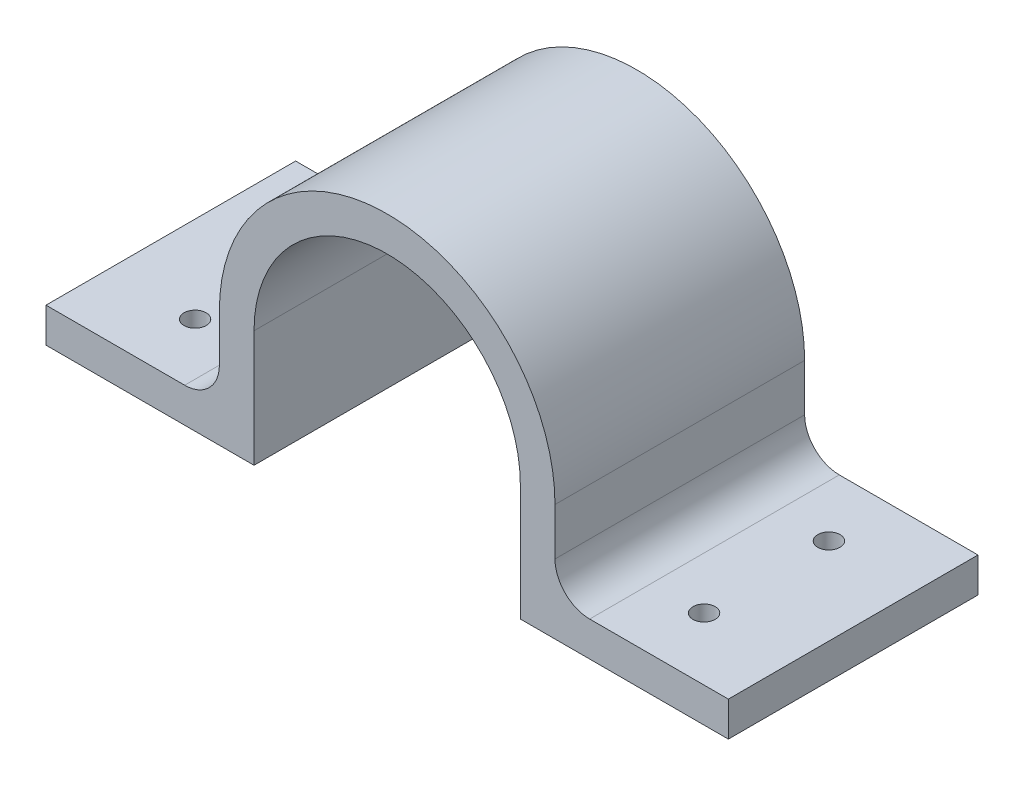
ISO-10303-21;
HEADER;
FILE_DESCRIPTION(('STEP AP214'),'2;1');
FILE_NAME('part.step','',(''),(''),'','','');
FILE_SCHEMA(('AUTOMOTIVE_DESIGN { 1 0 10303 214 1 1 1 1 }'));
ENDSEC;
DATA;
#1=APPLICATION_CONTEXT('core data for automotive mechanical design processes');
#2=APPLICATION_PROTOCOL_DEFINITION('international standard','automotive_design',2000,#1);
#3=PRODUCT_CONTEXT('',#1,'mechanical');
#4=PRODUCT('Part','Part','',(#3));
#5=PRODUCT_RELATED_PRODUCT_CATEGORY('part','',(#4));
#6=PRODUCT_DEFINITION_FORMATION('','',#4);
#7=PRODUCT_DEFINITION_CONTEXT('part definition',#1,'design');
#8=PRODUCT_DEFINITION('design','',#6,#7);
#9=PRODUCT_DEFINITION_SHAPE('','',#8);
#10=(LENGTH_UNIT() NAMED_UNIT(*) SI_UNIT(.MILLI.,.METRE.));
#11=(NAMED_UNIT(*) PLANE_ANGLE_UNIT() SI_UNIT($,.RADIAN.));
#12=(NAMED_UNIT(*) SI_UNIT($,.STERADIAN.) SOLID_ANGLE_UNIT());
#13=UNCERTAINTY_MEASURE_WITH_UNIT(LENGTH_MEASURE(1.E-05),#10,'distance_accuracy_value','');
#14=(GEOMETRIC_REPRESENTATION_CONTEXT(3) GLOBAL_UNCERTAINTY_ASSIGNED_CONTEXT((#13)) GLOBAL_UNIT_ASSIGNED_CONTEXT((#10,
#11,#12)) REPRESENTATION_CONTEXT('',''));
#15=CARTESIAN_POINT('',(0.,0.,0.));
#16=DIRECTION('',(0.,0.,1.));
#17=DIRECTION('',(1.,0.,0.));
#18=AXIS2_PLACEMENT_3D('',#15,#16,#17);
#19=CARTESIAN_POINT('',(24.2,0.,-36.));
#20=DIRECTION('',(1.,0.,0.));
#21=DIRECTION('',(0.,0.,-1.));
#22=AXIS2_PLACEMENT_3D('',#19,#20,#21);
#23=PLANE('',#22);
#24=DIRECTION('',(0.,1.,0.));
#25=VECTOR('',#24,1.);
#26=CARTESIAN_POINT('',(24.2,0.,0.));
#27=LINE('',#26,#25);
#28=CARTESIAN_POINT('',(24.2,-6.79999999999998,0.));
#29=VERTEX_POINT('',#28);
#30=CARTESIAN_POINT('',(24.2,0.,0.));
#31=VERTEX_POINT('',#30);
#32=EDGE_CURVE('E186',#29,#31,#27,.T.);
#33=ORIENTED_EDGE('',*,*,#32,.F.);
#34=DIRECTION('',(0.,0.,1.));
#35=VECTOR('',#34,1.);
#36=CARTESIAN_POINT('',(24.2,-6.79999999999998,-36.));
#37=LINE('',#36,#35);
#38=CARTESIAN_POINT('',(24.2,-6.79999999999998,-36.));
#39=VERTEX_POINT('',#38);
#40=EDGE_CURVE('E138',#29,#39,#37,.F.);
#41=ORIENTED_EDGE('',*,*,#40,.T.);
#42=DIRECTION('',(0.,1.,0.));
#43=VECTOR('',#42,1.);
#44=CARTESIAN_POINT('',(24.2,0.,-36.));
#45=LINE('',#44,#43);
#46=CARTESIAN_POINT('',(24.2,0.,-36.));
#47=VERTEX_POINT('',#46);
#48=EDGE_CURVE('E132',#39,#47,#45,.T.);
#49=ORIENTED_EDGE('',*,*,#48,.T.);
#50=DIRECTION('',(0.,0.,1.));
#51=VECTOR('',#50,1.);
#52=CARTESIAN_POINT('',(24.2,0.,-36.));
#53=LINE('',#52,#51);
#54=EDGE_CURVE('E135',#47,#31,#53,.T.);
#55=ORIENTED_EDGE('',*,*,#54,.T.);
#56=EDGE_LOOP('',(#33,#41,#49,#55));
#57=FACE_BOUND('',#56,.T.);
#58=ADVANCED_FACE('F33',(#57),#23,.T.);
#59=CARTESIAN_POINT('',(24.2,-11.8,-36.));
#60=DIRECTION('',(0.,1.,0.));
#61=DIRECTION('',(-1.,0.,0.));
#62=AXIS2_PLACEMENT_3D('',#59,#60,#61);
#63=PLANE('',#62);
#64=CARTESIAN_POINT('',(36.7,-11.8,-9.00000000000001));
#65=DIRECTION('',(0.,1.,0.));
#66=DIRECTION('',(-1.,0.,0.));
#67=AXIS2_PLACEMENT_3D('',#64,#65,#66);
#68=CIRCLE('',#67,1.59999999999999);
#69=CARTESIAN_POINT('',(35.1,-11.8,-9.00000000000001));
#70=VERTEX_POINT('',#69);
#71=EDGE_CURVE('E483',#70,#70,#68,.T.);
#72=ORIENTED_EDGE('',*,*,#71,.F.);
#73=EDGE_LOOP('',(#72));
#74=FACE_BOUND('',#73,.T.);
#75=CARTESIAN_POINT('',(36.7,-11.8,-27.));
#76=DIRECTION('',(0.,1.,0.));
#77=DIRECTION('',(1.,0.,0.));
#78=AXIS2_PLACEMENT_3D('',#75,#76,#77);
#79=CIRCLE('',#78,1.6);
#80=CARTESIAN_POINT('',(38.3,-11.8,-27.));
#81=VERTEX_POINT('',#80);
#82=EDGE_CURVE('E477',#81,#81,#79,.T.);
#83=ORIENTED_EDGE('',*,*,#82,.F.);
#84=EDGE_LOOP('',(#83));
#85=FACE_BOUND('',#84,.T.);
#86=DIRECTION('',(-1.,0.,0.));
#87=VECTOR('',#86,1.);
#88=CARTESIAN_POINT('',(24.2,-11.8,-36.));
#89=LINE('',#88,#87);
#90=CARTESIAN_POINT('',(49.2,-11.8,-36.));
#91=VERTEX_POINT('',#90);
#92=CARTESIAN_POINT('',(29.2,-11.8,-36.));
#93=VERTEX_POINT('',#92);
#94=EDGE_CURVE('E151',#91,#93,#89,.T.);
#95=ORIENTED_EDGE('',*,*,#94,.T.);
#96=DIRECTION('',(0.,0.,1.));
#97=VECTOR('',#96,1.);
#98=CARTESIAN_POINT('',(29.2,-11.8,0.));
#99=LINE('',#98,#97);
#100=CARTESIAN_POINT('',(29.2,-11.8,0.));
#101=VERTEX_POINT('',#100);
#102=EDGE_CURVE('E219',#93,#101,#99,.T.);
#103=ORIENTED_EDGE('',*,*,#102,.T.);
#104=DIRECTION('',(-1.,0.,0.));
#105=VECTOR('',#104,1.);
#106=CARTESIAN_POINT('',(24.2,-11.8,0.));
#107=LINE('',#106,#105);
#108=CARTESIAN_POINT('',(49.2,-11.8,0.));
#109=VERTEX_POINT('',#108);
#110=EDGE_CURVE('E143',#109,#101,#107,.T.);
#111=ORIENTED_EDGE('',*,*,#110,.F.);
#112=DIRECTION('',(0.,0.,1.));
#113=VECTOR('',#112,1.);
#114=CARTESIAN_POINT('',(49.2,-11.8,-36.));
#115=LINE('',#114,#113);
#116=EDGE_CURVE('E217',#91,#109,#115,.T.);
#117=ORIENTED_EDGE('',*,*,#116,.F.);
#118=EDGE_LOOP('',(#95,#103,#111,#117));
#119=FACE_BOUND('',#118,.T.);
#120=ADVANCED_FACE('F251',(#74,#85,#119),#63,.T.);
#121=CARTESIAN_POINT('',(49.2,-11.8,-36.));
#122=DIRECTION('',(1.,0.,0.));
#123=DIRECTION('',(0.,0.,-1.));
#124=AXIS2_PLACEMENT_3D('',#121,#122,#123);
#125=PLANE('',#124);
#126=DIRECTION('',(0.,1.,0.));
#127=VECTOR('',#126,1.);
#128=CARTESIAN_POINT('',(49.2,-11.8,0.));
#129=LINE('',#128,#127);
#130=CARTESIAN_POINT('',(49.2,-16.8,0.));
#131=VERTEX_POINT('',#130);
#132=EDGE_CURVE('E212',#131,#109,#129,.T.);
#133=ORIENTED_EDGE('',*,*,#132,.F.);
#134=DIRECTION('',(0.,0.,1.));
#135=VECTOR('',#134,1.);
#136=CARTESIAN_POINT('',(49.2,-16.8,-36.));
#137=LINE('',#136,#135);
#138=CARTESIAN_POINT('',(49.2,-16.8,-36.));
#139=VERTEX_POINT('',#138);
#140=EDGE_CURVE('E220',#139,#131,#137,.T.);
#141=ORIENTED_EDGE('',*,*,#140,.F.);
#142=DIRECTION('',(0.,1.,0.));
#143=VECTOR('',#142,1.);
#144=CARTESIAN_POINT('',(49.2,-11.8,-36.));
#145=LINE('',#144,#143);
#146=EDGE_CURVE('E181',#139,#91,#145,.T.);
#147=ORIENTED_EDGE('',*,*,#146,.T.);
#148=ORIENTED_EDGE('',*,*,#116,.T.);
#149=EDGE_LOOP('',(#133,#141,#147,#148));
#150=FACE_BOUND('',#149,.T.);
#151=ADVANCED_FACE('F258',(#150),#125,.T.);
#152=CARTESIAN_POINT('',(19.2,-16.8,-36.));
#153=DIRECTION('',(0.,-1.,0.));
#154=DIRECTION('',(1.,0.,0.));
#155=AXIS2_PLACEMENT_3D('',#152,#153,#154);
#156=PLANE('',#155);
#157=CARTESIAN_POINT('',(36.7,-16.8,-9.00000000000001));
#158=DIRECTION('',(0.,1.,0.));
#159=DIRECTION('',(-1.,0.,0.));
#160=AXIS2_PLACEMENT_3D('',#157,#158,#159);
#161=CIRCLE('',#160,1.59999999999999);
#162=CARTESIAN_POINT('',(35.1,-16.8,-9.00000000000001));
#163=VERTEX_POINT('',#162);
#164=EDGE_CURVE('E480',#163,#163,#161,.T.);
#165=ORIENTED_EDGE('',*,*,#164,.T.);
#166=EDGE_LOOP('',(#165));
#167=FACE_BOUND('',#166,.T.);
#168=CARTESIAN_POINT('',(36.7,-16.8,-27.));
#169=DIRECTION('',(0.,1.,0.));
#170=DIRECTION('',(1.,0.,0.));
#171=AXIS2_PLACEMENT_3D('',#168,#169,#170);
#172=CIRCLE('',#171,1.6);
#173=CARTESIAN_POINT('',(38.3,-16.8,-27.));
#174=VERTEX_POINT('',#173);
#175=EDGE_CURVE('E475',#174,#174,#172,.T.);
#176=ORIENTED_EDGE('',*,*,#175,.T.);
#177=EDGE_LOOP('',(#176));
#178=FACE_BOUND('',#177,.T.);
#179=DIRECTION('',(1.,0.,0.));
#180=VECTOR('',#179,1.);
#181=CARTESIAN_POINT('',(19.2,-16.8,0.));
#182=LINE('',#181,#180);
#183=CARTESIAN_POINT('',(19.2,-16.8,0.));
#184=VERTEX_POINT('',#183);
#185=EDGE_CURVE('E209',#184,#131,#182,.T.);
#186=ORIENTED_EDGE('',*,*,#185,.F.);
#187=DIRECTION('',(0.,0.,1.));
#188=VECTOR('',#187,1.);
#189=CARTESIAN_POINT('',(19.2,-16.8,-36.));
#190=LINE('',#189,#188);
#191=CARTESIAN_POINT('',(19.2,-16.8,-36.));
#192=VERTEX_POINT('',#191);
#193=EDGE_CURVE('E222',#192,#184,#190,.T.);
#194=ORIENTED_EDGE('',*,*,#193,.F.);
#195=DIRECTION('',(1.,0.,0.));
#196=VECTOR('',#195,1.);
#197=CARTESIAN_POINT('',(19.2,-16.8,-36.));
#198=LINE('',#197,#196);
#199=EDGE_CURVE('E178',#192,#139,#198,.T.);
#200=ORIENTED_EDGE('',*,*,#199,.T.);
#201=ORIENTED_EDGE('',*,*,#140,.T.);
#202=EDGE_LOOP('',(#186,#194,#200,#201));
#203=FACE_BOUND('',#202,.T.);
#204=ADVANCED_FACE('F262',(#167,#178,#203),#156,.T.);
#205=CARTESIAN_POINT('',(19.2,0.,-36.));
#206=DIRECTION('',(-1.,0.,0.));
#207=DIRECTION('',(0.,-1.,0.));
#208=AXIS2_PLACEMENT_3D('',#205,#206,#207);
#209=PLANE('',#208);
#210=DIRECTION('',(0.,-1.,0.));
#211=VECTOR('',#210,1.);
#212=CARTESIAN_POINT('',(19.2,0.,0.));
#213=LINE('',#212,#211);
#214=CARTESIAN_POINT('',(19.2,0.,0.));
#215=VERTEX_POINT('',#214);
#216=EDGE_CURVE('E206',#215,#184,#213,.T.);
#217=ORIENTED_EDGE('',*,*,#216,.F.);
#218=DIRECTION('',(0.,0.,1.));
#219=VECTOR('',#218,1.);
#220=CARTESIAN_POINT('',(19.2,0.,-36.));
#221=LINE('',#220,#219);
#222=CARTESIAN_POINT('',(19.2,0.,-36.));
#223=VERTEX_POINT('',#222);
#224=EDGE_CURVE('E224',#223,#215,#221,.T.);
#225=ORIENTED_EDGE('',*,*,#224,.F.);
#226=DIRECTION('',(0.,-1.,0.));
#227=VECTOR('',#226,1.);
#228=CARTESIAN_POINT('',(19.2,0.,-36.));
#229=LINE('',#228,#227);
#230=EDGE_CURVE('E175',#223,#192,#229,.T.);
#231=ORIENTED_EDGE('',*,*,#230,.T.);
#232=ORIENTED_EDGE('',*,*,#193,.T.);
#233=EDGE_LOOP('',(#217,#225,#231,#232));
#234=FACE_BOUND('',#233,.T.);
#235=ADVANCED_FACE('F265',(#234),#209,.T.);
#236=CARTESIAN_POINT('',(0.,0.,-36.));
#237=DIRECTION('',(0.,0.,1.));
#238=DIRECTION('',(1.,0.,0.));
#239=AXIS2_PLACEMENT_3D('',#236,#237,#238);
#240=CYLINDRICAL_SURFACE('',#239,19.2);
#241=CARTESIAN_POINT('',(0.,0.,0.));
#242=DIRECTION('',(0.,0.,-1.));
#243=DIRECTION('',(1.,0.,0.));
#244=AXIS2_PLACEMENT_3D('',#241,#242,#243);
#245=CIRCLE('',#244,19.2);
#246=CARTESIAN_POINT('',(-19.2,0.,0.));
#247=VERTEX_POINT('',#246);
#248=EDGE_CURVE('E203',#247,#215,#245,.T.);
#249=ORIENTED_EDGE('',*,*,#248,.F.);
#250=DIRECTION('',(0.,0.,1.));
#251=VECTOR('',#250,1.);
#252=CARTESIAN_POINT('',(-19.2,0.,-36.));
#253=LINE('',#252,#251);
#254=CARTESIAN_POINT('',(-19.2,0.,-36.));
#255=VERTEX_POINT('',#254);
#256=EDGE_CURVE('E226',#255,#247,#253,.T.);
#257=ORIENTED_EDGE('',*,*,#256,.F.);
#258=CARTESIAN_POINT('',(0.,0.,-36.));
#259=DIRECTION('',(0.,0.,-1.));
#260=DIRECTION('',(1.,0.,0.));
#261=AXIS2_PLACEMENT_3D('',#258,#259,#260);
#262=CIRCLE('',#261,19.2);
#263=EDGE_CURVE('E172',#255,#223,#262,.T.);
#264=ORIENTED_EDGE('',*,*,#263,.T.);
#265=ORIENTED_EDGE('',*,*,#224,.T.);
#266=EDGE_LOOP('',(#249,#257,#264,#265));
#267=FACE_BOUND('',#266,.T.);
#268=ADVANCED_FACE('F270',(#267),#240,.F.);
#269=CARTESIAN_POINT('',(-19.2,0.,-36.));
#270=DIRECTION('',(1.,0.,0.));
#271=DIRECTION('',(0.,0.,-1.));
#272=AXIS2_PLACEMENT_3D('',#269,#270,#271);
#273=PLANE('',#272);
#274=DIRECTION('',(0.,1.,0.));
#275=VECTOR('',#274,1.);
#276=CARTESIAN_POINT('',(-19.2,0.,0.));
#277=LINE('',#276,#275);
#278=CARTESIAN_POINT('',(-19.2,-16.8,0.));
#279=VERTEX_POINT('',#278);
#280=EDGE_CURVE('E200',#279,#247,#277,.T.);
#281=ORIENTED_EDGE('',*,*,#280,.F.);
#282=DIRECTION('',(0.,0.,1.));
#283=VECTOR('',#282,1.);
#284=CARTESIAN_POINT('',(-19.2,-16.8,-36.));
#285=LINE('',#284,#283);
#286=CARTESIAN_POINT('',(-19.2,-16.8,-36.));
#287=VERTEX_POINT('',#286);
#288=EDGE_CURVE('E228',#287,#279,#285,.T.);
#289=ORIENTED_EDGE('',*,*,#288,.F.);
#290=DIRECTION('',(0.,1.,0.));
#291=VECTOR('',#290,1.);
#292=CARTESIAN_POINT('',(-19.2,0.,-36.));
#293=LINE('',#292,#291);
#294=EDGE_CURVE('E169',#287,#255,#293,.T.);
#295=ORIENTED_EDGE('',*,*,#294,.T.);
#296=ORIENTED_EDGE('',*,*,#256,.T.);
#297=EDGE_LOOP('',(#281,#289,#295,#296));
#298=FACE_BOUND('',#297,.T.);
#299=ADVANCED_FACE('F273',(#298),#273,.T.);
#300=CARTESIAN_POINT('',(-19.2,-16.8,-36.));
#301=DIRECTION('',(0.,-1.,0.));
#302=DIRECTION('',(1.,0.,0.));
#303=AXIS2_PLACEMENT_3D('',#300,#301,#302);
#304=PLANE('',#303);
#305=CARTESIAN_POINT('',(-36.7,-16.8,-9.));
#306=DIRECTION('',(0.,1.,0.));
#307=DIRECTION('',(1.,0.,0.));
#308=AXIS2_PLACEMENT_3D('',#305,#306,#307);
#309=CIRCLE('',#308,1.59999999999999);
#310=CARTESIAN_POINT('',(-35.1,-16.8,-9.));
#311=VERTEX_POINT('',#310);
#312=EDGE_CURVE('E465',#311,#311,#309,.T.);
#313=ORIENTED_EDGE('',*,*,#312,.T.);
#314=EDGE_LOOP('',(#313));
#315=FACE_BOUND('',#314,.T.);
#316=CARTESIAN_POINT('',(-36.7,-16.8,-27.));
#317=DIRECTION('',(0.,1.,0.));
#318=DIRECTION('',(-1.,0.,0.));
#319=AXIS2_PLACEMENT_3D('',#316,#317,#318);
#320=CIRCLE('',#319,1.6);
#321=CARTESIAN_POINT('',(-38.3,-16.8,-27.));
#322=VERTEX_POINT('',#321);
#323=EDGE_CURVE('E188',#322,#322,#320,.T.);
#324=ORIENTED_EDGE('',*,*,#323,.T.);
#325=EDGE_LOOP('',(#324));
#326=FACE_BOUND('',#325,.T.);
#327=DIRECTION('',(1.,0.,0.));
#328=VECTOR('',#327,1.);
#329=CARTESIAN_POINT('',(-19.2,-16.8,0.));
#330=LINE('',#329,#328);
#331=CARTESIAN_POINT('',(-49.2,-16.8,0.));
#332=VERTEX_POINT('',#331);
#333=EDGE_CURVE('E197',#332,#279,#330,.T.);
#334=ORIENTED_EDGE('',*,*,#333,.F.);
#335=DIRECTION('',(0.,0.,1.));
#336=VECTOR('',#335,1.);
#337=CARTESIAN_POINT('',(-49.2,-16.8,-36.));
#338=LINE('',#337,#336);
#339=CARTESIAN_POINT('',(-49.2,-16.8,-36.));
#340=VERTEX_POINT('',#339);
#341=EDGE_CURVE('E230',#340,#332,#338,.T.);
#342=ORIENTED_EDGE('',*,*,#341,.F.);
#343=DIRECTION('',(1.,0.,0.));
#344=VECTOR('',#343,1.);
#345=CARTESIAN_POINT('',(-19.2,-16.8,-36.));
#346=LINE('',#345,#344);
#347=EDGE_CURVE('E166',#340,#287,#346,.T.);
#348=ORIENTED_EDGE('',*,*,#347,.T.);
#349=ORIENTED_EDGE('',*,*,#288,.T.);
#350=EDGE_LOOP('',(#334,#342,#348,#349));
#351=FACE_BOUND('',#350,.T.);
#352=ADVANCED_FACE('F278',(#315,#326,#351),#304,.T.);
#353=CARTESIAN_POINT('',(-49.2,-11.8,-36.));
#354=DIRECTION('',(-1.,0.,0.));
#355=DIRECTION('',(0.,0.,1.));
#356=AXIS2_PLACEMENT_3D('',#353,#354,#355);
#357=PLANE('',#356);
#358=DIRECTION('',(0.,-1.,0.));
#359=VECTOR('',#358,1.);
#360=CARTESIAN_POINT('',(-49.2,-11.8,0.));
#361=LINE('',#360,#359);
#362=CARTESIAN_POINT('',(-49.2,-11.8,0.));
#363=VERTEX_POINT('',#362);
#364=EDGE_CURVE('E194',#363,#332,#361,.T.);
#365=ORIENTED_EDGE('',*,*,#364,.F.);
#366=DIRECTION('',(0.,0.,1.));
#367=VECTOR('',#366,1.);
#368=CARTESIAN_POINT('',(-49.2,-11.8,-36.));
#369=LINE('',#368,#367);
#370=CARTESIAN_POINT('',(-49.2,-11.8,-36.));
#371=VERTEX_POINT('',#370);
#372=EDGE_CURVE('E232',#371,#363,#369,.T.);
#373=ORIENTED_EDGE('',*,*,#372,.F.);
#374=DIRECTION('',(0.,-1.,0.));
#375=VECTOR('',#374,1.);
#376=CARTESIAN_POINT('',(-49.2,-11.8,-36.));
#377=LINE('',#376,#375);
#378=EDGE_CURVE('E163',#371,#340,#377,.T.);
#379=ORIENTED_EDGE('',*,*,#378,.T.);
#380=ORIENTED_EDGE('',*,*,#341,.T.);
#381=EDGE_LOOP('',(#365,#373,#379,#380));
#382=FACE_BOUND('',#381,.T.);
#383=ADVANCED_FACE('F281',(#382),#357,.T.);
#384=CARTESIAN_POINT('',(-24.2,-11.8,-36.));
#385=DIRECTION('',(0.,1.,0.));
#386=DIRECTION('',(-1.,0.,0.));
#387=AXIS2_PLACEMENT_3D('',#384,#385,#386);
#388=PLANE('',#387);
#389=CARTESIAN_POINT('',(-36.7,-11.8,-9.));
#390=DIRECTION('',(0.,1.,0.));
#391=DIRECTION('',(1.,0.,0.));
#392=AXIS2_PLACEMENT_3D('',#389,#390,#391);
#393=CIRCLE('',#392,1.59999999999999);
#394=CARTESIAN_POINT('',(-35.1,-11.8,-9.));
#395=VERTEX_POINT('',#394);
#396=EDGE_CURVE('E472',#395,#395,#393,.T.);
#397=ORIENTED_EDGE('',*,*,#396,.F.);
#398=EDGE_LOOP('',(#397));
#399=FACE_BOUND('',#398,.T.);
#400=CARTESIAN_POINT('',(-36.7,-11.8,-27.));
#401=DIRECTION('',(0.,1.,0.));
#402=DIRECTION('',(-1.,0.,0.));
#403=AXIS2_PLACEMENT_3D('',#400,#401,#402);
#404=CIRCLE('',#403,1.6);
#405=CARTESIAN_POINT('',(-38.3,-11.8,-27.));
#406=VERTEX_POINT('',#405);
#407=EDGE_CURVE('E468',#406,#406,#404,.T.);
#408=ORIENTED_EDGE('',*,*,#407,.F.);
#409=EDGE_LOOP('',(#408));
#410=FACE_BOUND('',#409,.T.);
#411=DIRECTION('',(-1.,0.,0.));
#412=VECTOR('',#411,1.);
#413=CARTESIAN_POINT('',(-24.2,-11.8,0.));
#414=LINE('',#413,#412);
#415=CARTESIAN_POINT('',(-29.2,-11.8,0.));
#416=VERTEX_POINT('',#415);
#417=EDGE_CURVE('E192',#416,#363,#414,.T.);
#418=ORIENTED_EDGE('',*,*,#417,.F.);
#419=DIRECTION('',(0.,0.,1.));
#420=VECTOR('',#419,1.);
#421=CARTESIAN_POINT('',(-29.2,-11.8,-36.));
#422=LINE('',#421,#420);
#423=CARTESIAN_POINT('',(-29.2,-11.8,-36.));
#424=VERTEX_POINT('',#423);
#425=EDGE_CURVE('E48',#416,#424,#422,.F.);
#426=ORIENTED_EDGE('',*,*,#425,.T.);
#427=DIRECTION('',(-1.,0.,0.));
#428=VECTOR('',#427,1.);
#429=CARTESIAN_POINT('',(-24.2,-11.8,-36.));
#430=LINE('',#429,#428);
#431=EDGE_CURVE('E158',#424,#371,#430,.T.);
#432=ORIENTED_EDGE('',*,*,#431,.T.);
#433=ORIENTED_EDGE('',*,*,#372,.T.);
#434=EDGE_LOOP('',(#418,#426,#432,#433));
#435=FACE_BOUND('',#434,.T.);
#436=ADVANCED_FACE('F290',(#399,#410,#435),#388,.T.);
#437=CARTESIAN_POINT('',(-24.2,0.,-36.));
#438=DIRECTION('',(-1.,0.,0.));
#439=DIRECTION('',(0.,0.,1.));
#440=AXIS2_PLACEMENT_3D('',#437,#438,#439);
#441=PLANE('',#440);
#442=DIRECTION('',(0.,-1.,0.));
#443=VECTOR('',#442,1.);
#444=CARTESIAN_POINT('',(-24.2,0.,-36.));
#445=LINE('',#444,#443);
#446=CARTESIAN_POINT('',(-24.2,0.,-36.));
#447=VERTEX_POINT('',#446);
#448=CARTESIAN_POINT('',(-24.2,-6.79999999999999,-36.));
#449=VERTEX_POINT('',#448);
#450=EDGE_CURVE('E156',#447,#449,#445,.T.);
#451=ORIENTED_EDGE('',*,*,#450,.T.);
#452=DIRECTION('',(0.,0.,1.));
#453=VECTOR('',#452,1.);
#454=CARTESIAN_POINT('',(-24.2,-6.8,0.));
#455=LINE('',#454,#453);
#456=CARTESIAN_POINT('',(-24.2,-6.79999999999999,0.));
#457=VERTEX_POINT('',#456);
#458=EDGE_CURVE('E239',#449,#457,#455,.T.);
#459=ORIENTED_EDGE('',*,*,#458,.T.);
#460=DIRECTION('',(0.,-1.,0.));
#461=VECTOR('',#460,1.);
#462=CARTESIAN_POINT('',(-24.2,0.,0.));
#463=LINE('',#462,#461);
#464=CARTESIAN_POINT('',(-24.2,0.,0.));
#465=VERTEX_POINT('',#464);
#466=EDGE_CURVE('E190',#465,#457,#463,.T.);
#467=ORIENTED_EDGE('',*,*,#466,.F.);
#468=DIRECTION('',(0.,0.,1.));
#469=VECTOR('',#468,1.);
#470=CARTESIAN_POINT('',(-24.2,0.,-36.));
#471=LINE('',#470,#469);
#472=EDGE_CURVE('E150',#447,#465,#471,.T.);
#473=ORIENTED_EDGE('',*,*,#472,.F.);
#474=EDGE_LOOP('',(#451,#459,#467,#473));
#475=FACE_BOUND('',#474,.T.);
#476=ADVANCED_FACE('F288',(#475),#441,.T.);
#477=CARTESIAN_POINT('',(0.,0.,-36.));
#478=DIRECTION('',(0.,0.,1.));
#479=DIRECTION('',(1.,0.,0.));
#480=AXIS2_PLACEMENT_3D('',#477,#478,#479);
#481=CYLINDRICAL_SURFACE('',#480,24.2);
#482=CARTESIAN_POINT('',(0.,0.,0.));
#483=DIRECTION('',(0.,0.,1.));
#484=DIRECTION('',(1.,0.,0.));
#485=AXIS2_PLACEMENT_3D('',#482,#483,#484);
#486=CIRCLE('',#485,24.2);
#487=EDGE_CURVE('E149',#31,#465,#486,.T.);
#488=ORIENTED_EDGE('',*,*,#487,.F.);
#489=ORIENTED_EDGE('',*,*,#54,.F.);
#490=CARTESIAN_POINT('',(0.,0.,-36.));
#491=DIRECTION('',(0.,0.,1.));
#492=DIRECTION('',(1.,0.,0.));
#493=AXIS2_PLACEMENT_3D('',#490,#491,#492);
#494=CIRCLE('',#493,24.2);
#495=EDGE_CURVE('E142',#47,#447,#494,.T.);
#496=ORIENTED_EDGE('',*,*,#495,.T.);
#497=ORIENTED_EDGE('',*,*,#472,.T.);
#498=EDGE_LOOP('',(#488,#489,#496,#497));
#499=FACE_BOUND('',#498,.T.);
#500=ADVANCED_FACE('F147',(#499),#481,.T.);
#501=CARTESIAN_POINT('',(0.,0.,-36.));
#502=DIRECTION('',(0.,0.,1.));
#503=DIRECTION('',(1.,0.,0.));
#504=AXIS2_PLACEMENT_3D('',#501,#502,#503);
#505=PLANE('',#504);
#506=ORIENTED_EDGE('',*,*,#48,.F.);
#507=CARTESIAN_POINT('',(29.2,-6.79999999999998,-36.));
#508=DIRECTION('',(0.,0.,1.));
#509=DIRECTION('',(1.,0.,0.));
#510=AXIS2_PLACEMENT_3D('',#507,#508,#509);
#511=CIRCLE('',#510,5.);
#512=EDGE_CURVE('E245',#39,#93,#511,.T.);
#513=ORIENTED_EDGE('',*,*,#512,.T.);
#514=ORIENTED_EDGE('',*,*,#94,.F.);
#515=ORIENTED_EDGE('',*,*,#146,.F.);
#516=ORIENTED_EDGE('',*,*,#199,.F.);
#517=ORIENTED_EDGE('',*,*,#230,.F.);
#518=ORIENTED_EDGE('',*,*,#263,.F.);
#519=ORIENTED_EDGE('',*,*,#294,.F.);
#520=ORIENTED_EDGE('',*,*,#347,.F.);
#521=ORIENTED_EDGE('',*,*,#378,.F.);
#522=ORIENTED_EDGE('',*,*,#431,.F.);
#523=CARTESIAN_POINT('',(-29.2,-6.8,-36.));
#524=DIRECTION('',(0.,0.,1.));
#525=DIRECTION('',(1.,0.,0.));
#526=AXIS2_PLACEMENT_3D('',#523,#524,#525);
#527=CIRCLE('',#526,5.);
#528=EDGE_CURVE('E11',#424,#449,#527,.T.);
#529=ORIENTED_EDGE('',*,*,#528,.T.);
#530=ORIENTED_EDGE('',*,*,#450,.F.);
#531=ORIENTED_EDGE('',*,*,#495,.F.);
#532=EDGE_LOOP('',(#506,#513,#514,#515,#516,#517,#518,#519,#520,#521,#522,#529,#530,#531));
#533=FACE_BOUND('',#532,.T.);
#534=ADVANCED_FACE('F154',(#533),#505,.F.);
#535=CARTESIAN_POINT('',(0.,0.,0.));
#536=DIRECTION('',(0.,0.,1.));
#537=DIRECTION('',(1.,0.,0.));
#538=AXIS2_PLACEMENT_3D('',#535,#536,#537);
#539=PLANE('',#538);
#540=ORIENTED_EDGE('',*,*,#110,.T.);
#541=CARTESIAN_POINT('',(29.2,-6.79999999999998,0.));
#542=DIRECTION('',(0.,0.,1.));
#543=DIRECTION('',(1.,0.,0.));
#544=AXIS2_PLACEMENT_3D('',#541,#542,#543);
#545=CIRCLE('',#544,5.);
#546=EDGE_CURVE('E243',#101,#29,#545,.F.);
#547=ORIENTED_EDGE('',*,*,#546,.T.);
#548=ORIENTED_EDGE('',*,*,#32,.T.);
#549=ORIENTED_EDGE('',*,*,#487,.T.);
#550=ORIENTED_EDGE('',*,*,#466,.T.);
#551=CARTESIAN_POINT('',(-29.2,-6.8,0.));
#552=DIRECTION('',(0.,0.,1.));
#553=DIRECTION('',(1.,0.,0.));
#554=AXIS2_PLACEMENT_3D('',#551,#552,#553);
#555=CIRCLE('',#554,5.);
#556=EDGE_CURVE('E41',#457,#416,#555,.F.);
#557=ORIENTED_EDGE('',*,*,#556,.T.);
#558=ORIENTED_EDGE('',*,*,#417,.T.);
#559=ORIENTED_EDGE('',*,*,#364,.T.);
#560=ORIENTED_EDGE('',*,*,#333,.T.);
#561=ORIENTED_EDGE('',*,*,#280,.T.);
#562=ORIENTED_EDGE('',*,*,#248,.T.);
#563=ORIENTED_EDGE('',*,*,#216,.T.);
#564=ORIENTED_EDGE('',*,*,#185,.T.);
#565=ORIENTED_EDGE('',*,*,#132,.T.);
#566=EDGE_LOOP('',(#540,#547,#548,#549,#550,#557,#558,#559,#560,#561,#562,#563,#564,#565));
#567=FACE_BOUND('',#566,.T.);
#568=ADVANCED_FACE('F254',(#567),#539,.T.);
#569=CARTESIAN_POINT('',(-36.7,-16.8,-27.));
#570=DIRECTION('',(0.,1.,0.));
#571=DIRECTION('',(-1.,0.,0.));
#572=AXIS2_PLACEMENT_3D('',#569,#570,#571);
#573=CYLINDRICAL_SURFACE('',#572,1.6);
#574=ORIENTED_EDGE('',*,*,#323,.F.);
#575=EDGE_LOOP('',(#574));
#576=FACE_BOUND('',#575,.T.);
#577=ORIENTED_EDGE('',*,*,#407,.T.);
#578=EDGE_LOOP('',(#577));
#579=FACE_BOUND('',#578,.T.);
#580=ADVANCED_FACE('F326',(#576,#579),#573,.F.);
#581=CARTESIAN_POINT('',(-36.7,-16.8,-9.));
#582=DIRECTION('',(0.,1.,0.));
#583=DIRECTION('',(-1.,0.,0.));
#584=AXIS2_PLACEMENT_3D('',#581,#582,#583);
#585=CYLINDRICAL_SURFACE('',#584,1.59999999999999);
#586=ORIENTED_EDGE('',*,*,#312,.F.);
#587=EDGE_LOOP('',(#586));
#588=FACE_BOUND('',#587,.T.);
#589=ORIENTED_EDGE('',*,*,#396,.T.);
#590=EDGE_LOOP('',(#589));
#591=FACE_BOUND('',#590,.T.);
#592=ADVANCED_FACE('F318',(#588,#591),#585,.F.);
#593=CARTESIAN_POINT('',(36.7,-16.8,-27.));
#594=DIRECTION('',(0.,1.,0.));
#595=DIRECTION('',(-1.,0.,0.));
#596=AXIS2_PLACEMENT_3D('',#593,#594,#595);
#597=CYLINDRICAL_SURFACE('',#596,1.6);
#598=ORIENTED_EDGE('',*,*,#175,.F.);
#599=EDGE_LOOP('',(#598));
#600=FACE_BOUND('',#599,.T.);
#601=ORIENTED_EDGE('',*,*,#82,.T.);
#602=EDGE_LOOP('',(#601));
#603=FACE_BOUND('',#602,.T.);
#604=ADVANCED_FACE('F312',(#600,#603),#597,.F.);
#605=CARTESIAN_POINT('',(36.7,-16.8,-9.00000000000001));
#606=DIRECTION('',(0.,1.,0.));
#607=DIRECTION('',(-1.,0.,0.));
#608=AXIS2_PLACEMENT_3D('',#605,#606,#607);
#609=CYLINDRICAL_SURFACE('',#608,1.59999999999999);
#610=ORIENTED_EDGE('',*,*,#164,.F.);
#611=EDGE_LOOP('',(#610));
#612=FACE_BOUND('',#611,.T.);
#613=ORIENTED_EDGE('',*,*,#71,.T.);
#614=EDGE_LOOP('',(#613));
#615=FACE_BOUND('',#614,.T.);
#616=ADVANCED_FACE('F307',(#612,#615),#609,.F.);
#617=CARTESIAN_POINT('',(29.2,-6.79999999999998,-36.));
#618=DIRECTION('',(0.,0.,-1.));
#619=DIRECTION('',(-1.,0.,0.));
#620=AXIS2_PLACEMENT_3D('',#617,#618,#619);
#621=CYLINDRICAL_SURFACE('',#620,5.);
#622=ORIENTED_EDGE('',*,*,#512,.F.);
#623=ORIENTED_EDGE('',*,*,#40,.F.);
#624=ORIENTED_EDGE('',*,*,#546,.F.);
#625=ORIENTED_EDGE('',*,*,#102,.F.);
#626=EDGE_LOOP('',(#622,#623,#624,#625));
#627=FACE_BOUND('',#626,.T.);
#628=ADVANCED_FACE('F253',(#627),#621,.F.);
#629=CARTESIAN_POINT('',(-29.2,-6.8,-36.));
#630=DIRECTION('',(0.,0.,-1.));
#631=DIRECTION('',(-1.,0.,0.));
#632=AXIS2_PLACEMENT_3D('',#629,#630,#631);
#633=CYLINDRICAL_SURFACE('',#632,5.);
#634=ORIENTED_EDGE('',*,*,#528,.F.);
#635=ORIENTED_EDGE('',*,*,#425,.F.);
#636=ORIENTED_EDGE('',*,*,#556,.F.);
#637=ORIENTED_EDGE('',*,*,#458,.F.);
#638=EDGE_LOOP('',(#634,#635,#636,#637));
#639=FACE_BOUND('',#638,.T.);
#640=ADVANCED_FACE('F35',(#639),#633,.F.);
#641=CLOSED_SHELL('',(#58,#120,#151,#204,#235,#268,#299,#352,#383,#436,#476,#500,#534,#568,#580,
#592,#604,#616,#628,#640));
#642=MANIFOLD_SOLID_BREP('B2',#641);
#643=ADVANCED_BREP_SHAPE_REPRESENTATION('',(#18,#642),#14);
#644=SHAPE_DEFINITION_REPRESENTATION(#9,#643);
ENDSEC;
END-ISO-10303-21;
